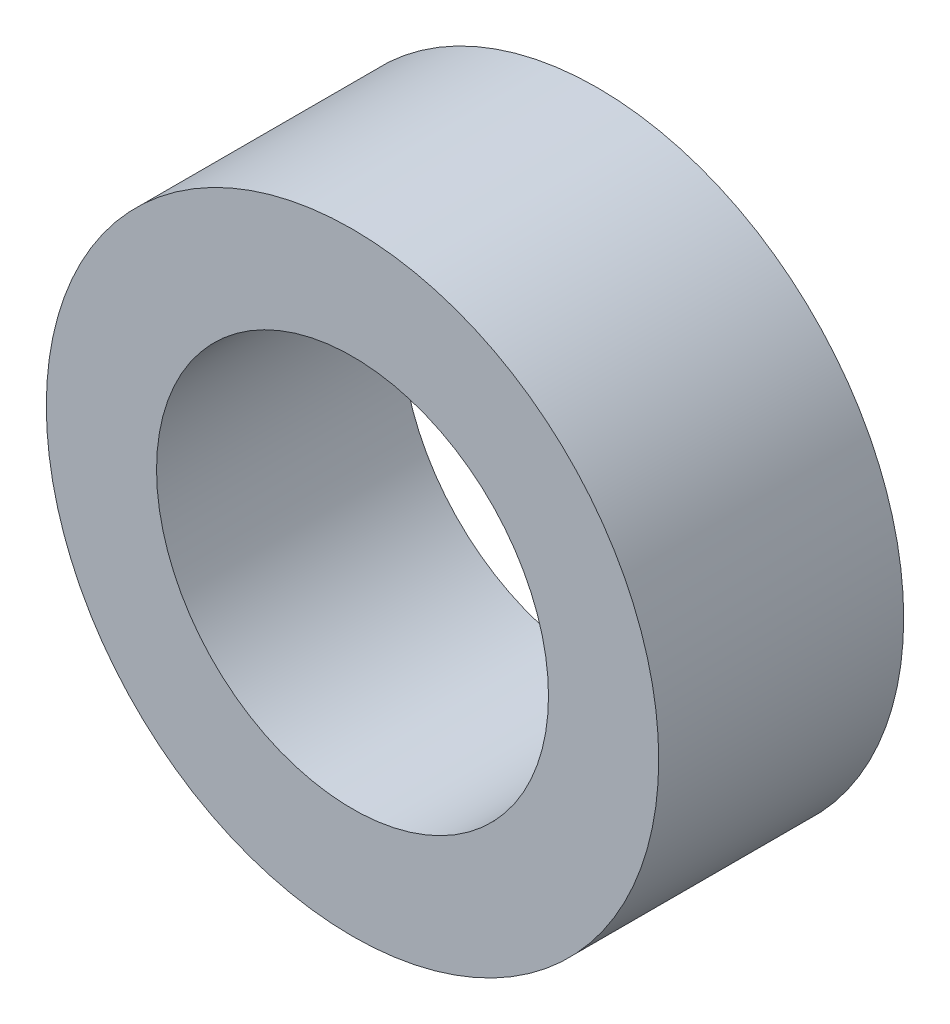
ISO-10303-21;
HEADER;
FILE_DESCRIPTION(('STEP AP214'),'2;1');
FILE_NAME('part.step','',(''),(''),'','','');
FILE_SCHEMA(('AUTOMOTIVE_DESIGN { 1 0 10303 214 1 1 1 1 }'));
ENDSEC;
DATA;
#1=APPLICATION_CONTEXT('core data for automotive mechanical design processes');
#2=APPLICATION_PROTOCOL_DEFINITION('international standard','automotive_design',2000,#1);
#3=PRODUCT_CONTEXT('',#1,'mechanical');
#4=PRODUCT('Part','Part','',(#3));
#5=PRODUCT_RELATED_PRODUCT_CATEGORY('part','',(#4));
#6=PRODUCT_DEFINITION_FORMATION('','',#4);
#7=PRODUCT_DEFINITION_CONTEXT('part definition',#1,'design');
#8=PRODUCT_DEFINITION('design','',#6,#7);
#9=PRODUCT_DEFINITION_SHAPE('','',#8);
#10=(LENGTH_UNIT() NAMED_UNIT(*) SI_UNIT(.MILLI.,.METRE.));
#11=(NAMED_UNIT(*) PLANE_ANGLE_UNIT() SI_UNIT($,.RADIAN.));
#12=(NAMED_UNIT(*) SI_UNIT($,.STERADIAN.) SOLID_ANGLE_UNIT());
#13=UNCERTAINTY_MEASURE_WITH_UNIT(LENGTH_MEASURE(1.E-05),#10,'distance_accuracy_value','');
#14=(GEOMETRIC_REPRESENTATION_CONTEXT(3) GLOBAL_UNCERTAINTY_ASSIGNED_CONTEXT((#13)) GLOBAL_UNIT_ASSIGNED_CONTEXT((#10,
#11,#12)) REPRESENTATION_CONTEXT('',''));
#15=CARTESIAN_POINT('',(0.,0.,0.));
#16=DIRECTION('',(0.,0.,1.));
#17=DIRECTION('',(1.,0.,0.));
#18=AXIS2_PLACEMENT_3D('',#15,#16,#17);
#19=CARTESIAN_POINT('',(0.,0.,4.));
#20=DIRECTION('',(0.,0.,1.));
#21=DIRECTION('',(1.,0.,0.));
#22=AXIS2_PLACEMENT_3D('',#19,#20,#21);
#23=PLANE('',#22);
#24=CARTESIAN_POINT('',(0.,0.,4.));
#25=DIRECTION('',(0.,0.,1.));
#26=DIRECTION('',(1.,0.,0.));
#27=AXIS2_PLACEMENT_3D('',#24,#25,#26);
#28=CIRCLE('',#27,5.);
#29=CARTESIAN_POINT('',(5.,0.,4.));
#30=VERTEX_POINT('',#29);
#31=EDGE_CURVE('E10',#30,#30,#28,.T.);
#32=ORIENTED_EDGE('',*,*,#31,.T.);
#33=EDGE_LOOP('',(#32));
#34=FACE_BOUND('',#33,.T.);
#35=CARTESIAN_POINT('',(0.,0.,4.));
#36=DIRECTION('',(0.,0.,1.));
#37=DIRECTION('',(1.,0.,0.));
#38=AXIS2_PLACEMENT_3D('',#35,#36,#37);
#39=CIRCLE('',#38,3.2);
#40=CARTESIAN_POINT('',(3.2,0.,4.));
#41=VERTEX_POINT('',#40);
#42=EDGE_CURVE('E50',#41,#41,#39,.T.);
#43=ORIENTED_EDGE('',*,*,#42,.F.);
#44=EDGE_LOOP('',(#43));
#45=FACE_BOUND('',#44,.T.);
#46=ADVANCED_FACE('F37',(#34,#45),#23,.T.);
#47=CARTESIAN_POINT('',(0.,0.,0.));
#48=DIRECTION('',(0.,0.,1.));
#49=DIRECTION('',(1.,0.,0.));
#50=AXIS2_PLACEMENT_3D('',#47,#48,#49);
#51=PLANE('',#50);
#52=CARTESIAN_POINT('',(0.,0.,0.));
#53=DIRECTION('',(0.,0.,1.));
#54=DIRECTION('',(1.,0.,0.));
#55=AXIS2_PLACEMENT_3D('',#52,#53,#54);
#56=CIRCLE('',#55,5.);
#57=CARTESIAN_POINT('',(5.,0.,0.));
#58=VERTEX_POINT('',#57);
#59=EDGE_CURVE('E41',#58,#58,#56,.T.);
#60=ORIENTED_EDGE('',*,*,#59,.F.);
#61=EDGE_LOOP('',(#60));
#62=FACE_BOUND('',#61,.T.);
#63=CARTESIAN_POINT('',(0.,0.,0.));
#64=DIRECTION('',(0.,0.,1.));
#65=DIRECTION('',(1.,0.,0.));
#66=AXIS2_PLACEMENT_3D('',#63,#64,#65);
#67=CIRCLE('',#66,3.2);
#68=CARTESIAN_POINT('',(3.2,0.,0.));
#69=VERTEX_POINT('',#68);
#70=EDGE_CURVE('E52',#69,#69,#67,.T.);
#71=ORIENTED_EDGE('',*,*,#70,.T.);
#72=EDGE_LOOP('',(#71));
#73=FACE_BOUND('',#72,.T.);
#74=ADVANCED_FACE('F64',(#62,#73),#51,.F.);
#75=CARTESIAN_POINT('',(0.,0.,4.));
#76=DIRECTION('',(0.,0.,-1.));
#77=DIRECTION('',(-1.,0.,0.));
#78=AXIS2_PLACEMENT_3D('',#75,#76,#77);
#79=CYLINDRICAL_SURFACE('',#78,5.);
#80=ORIENTED_EDGE('',*,*,#31,.F.);
#81=EDGE_LOOP('',(#80));
#82=FACE_BOUND('',#81,.T.);
#83=ORIENTED_EDGE('',*,*,#59,.T.);
#84=EDGE_LOOP('',(#83));
#85=FACE_BOUND('',#84,.T.);
#86=ADVANCED_FACE('F39',(#82,#85),#79,.T.);
#87=CARTESIAN_POINT('',(0.,0.,4.));
#88=DIRECTION('',(0.,0.,-1.));
#89=DIRECTION('',(-1.,0.,0.));
#90=AXIS2_PLACEMENT_3D('',#87,#88,#89);
#91=CYLINDRICAL_SURFACE('',#90,3.2);
#92=ORIENTED_EDGE('',*,*,#42,.T.);
#93=EDGE_LOOP('',(#92));
#94=FACE_BOUND('',#93,.T.);
#95=ORIENTED_EDGE('',*,*,#70,.F.);
#96=EDGE_LOOP('',(#95));
#97=FACE_BOUND('',#96,.T.);
#98=ADVANCED_FACE('F60',(#94,#97),#91,.F.);
#99=CLOSED_SHELL('',(#46,#74,#86,#98));
#100=MANIFOLD_SOLID_BREP('B2',#99);
#101=ADVANCED_BREP_SHAPE_REPRESENTATION('',(#18,#100),#14);
#102=SHAPE_DEFINITION_REPRESENTATION(#9,#101);
ENDSEC;
END-ISO-10303-21;
